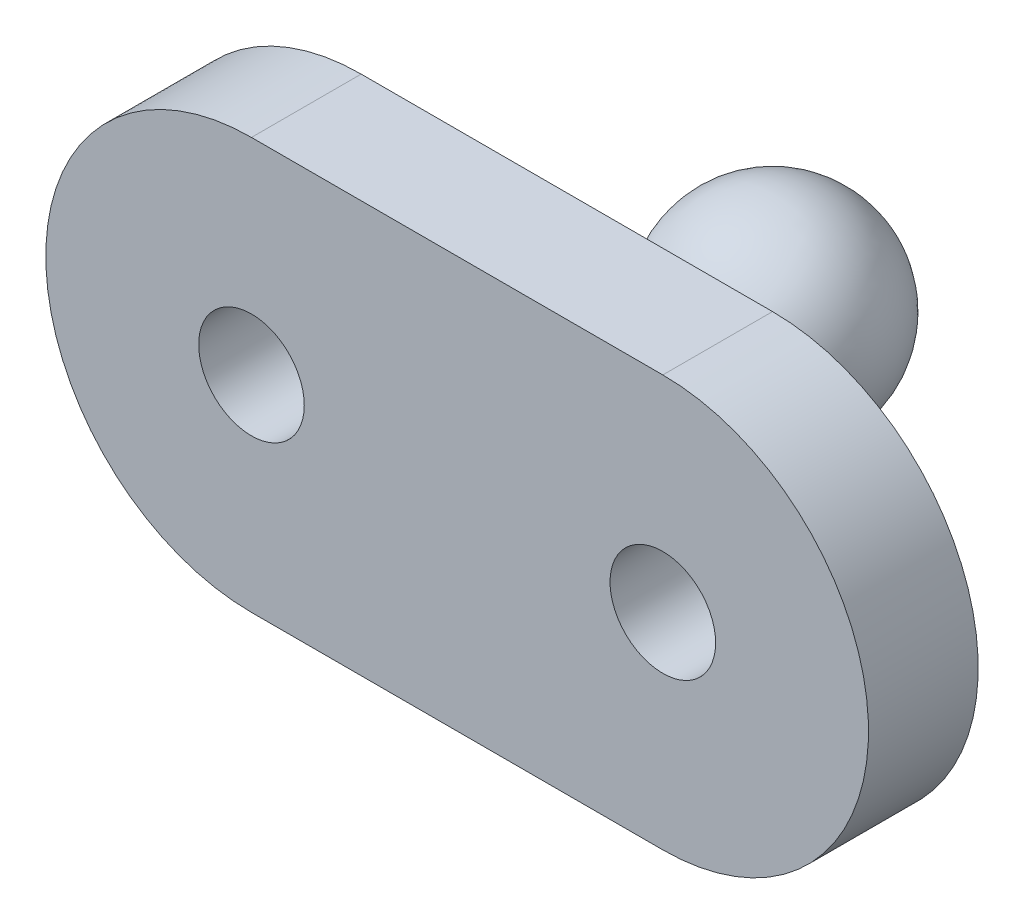
ISO-10303-21;
HEADER;
FILE_DESCRIPTION(('STEP AP214'),'2;1');
FILE_NAME('part.step','',(''),(''),'','','');
FILE_SCHEMA(('AUTOMOTIVE_DESIGN { 1 0 10303 214 1 1 1 1 }'));
ENDSEC;
DATA;
#1=APPLICATION_CONTEXT('core data for automotive mechanical design processes');
#2=APPLICATION_PROTOCOL_DEFINITION('international standard','automotive_design',2000,#1);
#3=PRODUCT_CONTEXT('',#1,'mechanical');
#4=PRODUCT('Part','Part','',(#3));
#5=PRODUCT_RELATED_PRODUCT_CATEGORY('part','',(#4));
#6=PRODUCT_DEFINITION_FORMATION('','',#4);
#7=PRODUCT_DEFINITION_CONTEXT('part definition',#1,'design');
#8=PRODUCT_DEFINITION('design','',#6,#7);
#9=PRODUCT_DEFINITION_SHAPE('','',#8);
#10=(LENGTH_UNIT() NAMED_UNIT(*) SI_UNIT(.MILLI.,.METRE.));
#11=(NAMED_UNIT(*) PLANE_ANGLE_UNIT() SI_UNIT($,.RADIAN.));
#12=(NAMED_UNIT(*) SI_UNIT($,.STERADIAN.) SOLID_ANGLE_UNIT());
#13=UNCERTAINTY_MEASURE_WITH_UNIT(LENGTH_MEASURE(1.E-05),#10,'distance_accuracy_value','');
#14=(GEOMETRIC_REPRESENTATION_CONTEXT(3) GLOBAL_UNCERTAINTY_ASSIGNED_CONTEXT((#13)) GLOBAL_UNIT_ASSIGNED_CONTEXT((#10,
#11,#12)) REPRESENTATION_CONTEXT('',''));
#15=CARTESIAN_POINT('',(0.,0.,0.));
#16=DIRECTION('',(0.,0.,1.));
#17=DIRECTION('',(1.,0.,0.));
#18=AXIS2_PLACEMENT_3D('',#15,#16,#17);
#19=CARTESIAN_POINT('',(-7.5,0.,4.));
#20=DIRECTION('',(0.,0.,1.));
#21=DIRECTION('',(1.,0.,0.));
#22=AXIS2_PLACEMENT_3D('',#19,#20,#21);
#23=PLANE('',#22);
#24=CARTESIAN_POINT('',(7.5,0.,4.));
#25=DIRECTION('',(0.,0.,1.));
#26=DIRECTION('',(1.,0.,0.));
#27=AXIS2_PLACEMENT_3D('',#24,#25,#26);
#28=CIRCLE('',#27,1.925);
#29=CARTESIAN_POINT('',(9.425,0.,4.));
#30=VERTEX_POINT('',#29);
#31=EDGE_CURVE('E113',#30,#30,#28,.T.);
#32=ORIENTED_EDGE('',*,*,#31,.F.);
#33=EDGE_LOOP('',(#32));
#34=FACE_BOUND('',#33,.T.);
#35=CARTESIAN_POINT('',(-7.5,0.,4.));
#36=DIRECTION('',(0.,0.,1.));
#37=DIRECTION('',(1.,0.,0.));
#38=AXIS2_PLACEMENT_3D('',#35,#36,#37);
#39=CIRCLE('',#38,7.5);
#40=CARTESIAN_POINT('',(-7.5,7.5,4.));
#41=VERTEX_POINT('',#40);
#42=CARTESIAN_POINT('',(-7.5,-7.5,4.));
#43=VERTEX_POINT('',#42);
#44=EDGE_CURVE('E95',#41,#43,#39,.T.);
#45=ORIENTED_EDGE('',*,*,#44,.T.);
#46=DIRECTION('',(1.,0.,0.));
#47=VECTOR('',#46,1.);
#48=CARTESIAN_POINT('',(-7.5,-7.5,4.));
#49=LINE('',#48,#47);
#50=CARTESIAN_POINT('',(7.5,-7.5,4.));
#51=VERTEX_POINT('',#50);
#52=EDGE_CURVE('E90',#43,#51,#49,.T.);
#53=ORIENTED_EDGE('',*,*,#52,.T.);
#54=CARTESIAN_POINT('',(7.5,0.,4.));
#55=DIRECTION('',(0.,0.,1.));
#56=DIRECTION('',(1.,0.,0.));
#57=AXIS2_PLACEMENT_3D('',#54,#55,#56);
#58=CIRCLE('',#57,7.5);
#59=CARTESIAN_POINT('',(7.5,7.50000000000001,4.));
#60=VERTEX_POINT('',#59);
#61=EDGE_CURVE('E93',#51,#60,#58,.T.);
#62=ORIENTED_EDGE('',*,*,#61,.T.);
#63=DIRECTION('',(-1.,0.,0.));
#64=VECTOR('',#63,1.);
#65=CARTESIAN_POINT('',(-7.5,7.5,4.));
#66=LINE('',#65,#64);
#67=EDGE_CURVE('E59',#60,#41,#66,.T.);
#68=ORIENTED_EDGE('',*,*,#67,.T.);
#69=EDGE_LOOP('',(#45,#53,#62,#68));
#70=FACE_BOUND('',#69,.T.);
#71=CARTESIAN_POINT('',(-7.5,0.,4.));
#72=DIRECTION('',(0.,0.,1.));
#73=DIRECTION('',(1.,0.,0.));
#74=AXIS2_PLACEMENT_3D('',#71,#72,#73);
#75=CIRCLE('',#74,1.925);
#76=CARTESIAN_POINT('',(-5.575,0.,4.));
#77=VERTEX_POINT('',#76);
#78=EDGE_CURVE('E171',#77,#77,#75,.T.);
#79=ORIENTED_EDGE('',*,*,#78,.F.);
#80=EDGE_LOOP('',(#79));
#81=FACE_BOUND('',#80,.T.);
#82=ADVANCED_FACE('F42',(#34,#70,#81),#23,.T.);
#83=CARTESIAN_POINT('',(-7.5,0.,0.));
#84=DIRECTION('',(0.,0.,1.));
#85=DIRECTION('',(1.,0.,0.));
#86=AXIS2_PLACEMENT_3D('',#83,#84,#85);
#87=PLANE('',#86);
#88=CARTESIAN_POINT('',(0.,0.,0.));
#89=DIRECTION('',(0.,0.,1.));
#90=DIRECTION('',(1.,0.,0.));
#91=AXIS2_PLACEMENT_3D('',#88,#89,#90);
#92=CIRCLE('',#91,5.21496268633627);
#93=CARTESIAN_POINT('',(5.21496268633627,0.,0.));
#94=VERTEX_POINT('',#93);
#95=EDGE_CURVE('E11',#94,#94,#92,.T.);
#96=ORIENTED_EDGE('',*,*,#95,.T.);
#97=EDGE_LOOP('',(#96));
#98=FACE_BOUND('',#97,.T.);
#99=CARTESIAN_POINT('',(-7.5,0.,0.));
#100=DIRECTION('',(0.,0.,1.));
#101=DIRECTION('',(1.,0.,0.));
#102=AXIS2_PLACEMENT_3D('',#99,#100,#101);
#103=CIRCLE('',#102,7.5);
#104=CARTESIAN_POINT('',(-7.5,7.5,0.));
#105=VERTEX_POINT('',#104);
#106=CARTESIAN_POINT('',(-7.5,-7.5,0.));
#107=VERTEX_POINT('',#106);
#108=EDGE_CURVE('E110',#105,#107,#103,.T.);
#109=ORIENTED_EDGE('',*,*,#108,.F.);
#110=DIRECTION('',(-1.,0.,0.));
#111=VECTOR('',#110,1.);
#112=CARTESIAN_POINT('',(-7.5,7.5,0.));
#113=LINE('',#112,#111);
#114=CARTESIAN_POINT('',(7.5,7.50000000000001,0.));
#115=VERTEX_POINT('',#114);
#116=EDGE_CURVE('E82',#115,#105,#113,.T.);
#117=ORIENTED_EDGE('',*,*,#116,.F.);
#118=CARTESIAN_POINT('',(7.5,0.,0.));
#119=DIRECTION('',(0.,0.,1.));
#120=DIRECTION('',(1.,0.,0.));
#121=AXIS2_PLACEMENT_3D('',#118,#119,#120);
#122=CIRCLE('',#121,7.5);
#123=CARTESIAN_POINT('',(7.5,-7.5,0.));
#124=VERTEX_POINT('',#123);
#125=EDGE_CURVE('E76',#124,#115,#122,.T.);
#126=ORIENTED_EDGE('',*,*,#125,.F.);
#127=DIRECTION('',(1.,0.,0.));
#128=VECTOR('',#127,1.);
#129=CARTESIAN_POINT('',(-7.5,-7.5,0.));
#130=LINE('',#129,#128);
#131=EDGE_CURVE('E100',#107,#124,#130,.T.);
#132=ORIENTED_EDGE('',*,*,#131,.F.);
#133=EDGE_LOOP('',(#109,#117,#126,#132));
#134=FACE_BOUND('',#133,.T.);
#135=CARTESIAN_POINT('',(7.5,0.,0.));
#136=DIRECTION('',(0.,0.,1.));
#137=DIRECTION('',(1.,0.,0.));
#138=AXIS2_PLACEMENT_3D('',#135,#136,#137);
#139=CIRCLE('',#138,1.925);
#140=CARTESIAN_POINT('',(9.425,0.,0.));
#141=VERTEX_POINT('',#140);
#142=EDGE_CURVE('E166',#141,#141,#139,.T.);
#143=ORIENTED_EDGE('',*,*,#142,.T.);
#144=EDGE_LOOP('',(#143));
#145=FACE_BOUND('',#144,.T.);
#146=CARTESIAN_POINT('',(-7.5,0.,0.));
#147=DIRECTION('',(0.,0.,1.));
#148=DIRECTION('',(1.,0.,0.));
#149=AXIS2_PLACEMENT_3D('',#146,#147,#148);
#150=CIRCLE('',#149,1.925);
#151=CARTESIAN_POINT('',(-5.575,0.,0.));
#152=VERTEX_POINT('',#151);
#153=EDGE_CURVE('E169',#152,#152,#150,.T.);
#154=ORIENTED_EDGE('',*,*,#153,.T.);
#155=EDGE_LOOP('',(#154));
#156=FACE_BOUND('',#155,.T.);
#157=ADVANCED_FACE('F136',(#98,#134,#145,#156),#87,.F.);
#158=CARTESIAN_POINT('',(-7.5,0.,4.));
#159=DIRECTION('',(0.,0.,-1.));
#160=DIRECTION('',(-1.,0.,0.));
#161=AXIS2_PLACEMENT_3D('',#158,#159,#160);
#162=CYLINDRICAL_SURFACE('',#161,7.5);
#163=ORIENTED_EDGE('',*,*,#108,.T.);
#164=DIRECTION('',(0.,0.,-1.));
#165=VECTOR('',#164,1.);
#166=CARTESIAN_POINT('',(-7.5,-7.5,4.));
#167=LINE('',#166,#165);
#168=EDGE_CURVE('E101',#43,#107,#167,.T.);
#169=ORIENTED_EDGE('',*,*,#168,.F.);
#170=ORIENTED_EDGE('',*,*,#44,.F.);
#171=DIRECTION('',(0.,0.,-1.));
#172=VECTOR('',#171,1.);
#173=CARTESIAN_POINT('',(-7.5,7.5,4.));
#174=LINE('',#173,#172);
#175=EDGE_CURVE('E106',#41,#105,#174,.T.);
#176=ORIENTED_EDGE('',*,*,#175,.T.);
#177=EDGE_LOOP('',(#163,#169,#170,#176));
#178=FACE_BOUND('',#177,.T.);
#179=ADVANCED_FACE('F143',(#178),#162,.T.);
#180=CARTESIAN_POINT('',(-7.5,-7.5,4.));
#181=DIRECTION('',(0.,1.,0.));
#182=DIRECTION('',(-1.,0.,0.));
#183=AXIS2_PLACEMENT_3D('',#180,#181,#182);
#184=PLANE('',#183);
#185=ORIENTED_EDGE('',*,*,#131,.T.);
#186=DIRECTION('',(0.,0.,-1.));
#187=VECTOR('',#186,1.);
#188=CARTESIAN_POINT('',(7.5,-7.5,4.));
#189=LINE('',#188,#187);
#190=EDGE_CURVE('E98',#51,#124,#189,.T.);
#191=ORIENTED_EDGE('',*,*,#190,.F.);
#192=ORIENTED_EDGE('',*,*,#52,.F.);
#193=ORIENTED_EDGE('',*,*,#168,.T.);
#194=EDGE_LOOP('',(#185,#191,#192,#193));
#195=FACE_BOUND('',#194,.T.);
#196=ADVANCED_FACE('F99',(#195),#184,.F.);
#197=CARTESIAN_POINT('',(7.5,0.,4.));
#198=DIRECTION('',(0.,0.,-1.));
#199=DIRECTION('',(-1.,0.,0.));
#200=AXIS2_PLACEMENT_3D('',#197,#198,#199);
#201=CYLINDRICAL_SURFACE('',#200,7.5);
#202=ORIENTED_EDGE('',*,*,#125,.T.);
#203=DIRECTION('',(0.,0.,-1.));
#204=VECTOR('',#203,1.);
#205=CARTESIAN_POINT('',(7.5,7.50000000000001,4.));
#206=LINE('',#205,#204);
#207=EDGE_CURVE('E102',#60,#115,#206,.T.);
#208=ORIENTED_EDGE('',*,*,#207,.F.);
#209=ORIENTED_EDGE('',*,*,#61,.F.);
#210=ORIENTED_EDGE('',*,*,#190,.T.);
#211=EDGE_LOOP('',(#202,#208,#209,#210));
#212=FACE_BOUND('',#211,.T.);
#213=ADVANCED_FACE('F104',(#212),#201,.T.);
#214=CARTESIAN_POINT('',(-7.5,7.5,4.));
#215=DIRECTION('',(0.,-1.,0.));
#216=DIRECTION('',(1.,0.,0.));
#217=AXIS2_PLACEMENT_3D('',#214,#215,#216);
#218=PLANE('',#217);
#219=ORIENTED_EDGE('',*,*,#116,.T.);
#220=ORIENTED_EDGE('',*,*,#175,.F.);
#221=ORIENTED_EDGE('',*,*,#67,.F.);
#222=ORIENTED_EDGE('',*,*,#207,.T.);
#223=EDGE_LOOP('',(#219,#220,#221,#222));
#224=FACE_BOUND('',#223,.T.);
#225=ADVANCED_FACE('F151',(#224),#218,.F.);
#226=CARTESIAN_POINT('',(7.5,0.,4.));
#227=DIRECTION('',(0.,0.,-1.));
#228=DIRECTION('',(-1.,0.,0.));
#229=AXIS2_PLACEMENT_3D('',#226,#227,#228);
#230=CYLINDRICAL_SURFACE('',#229,1.925);
#231=ORIENTED_EDGE('',*,*,#31,.T.);
#232=EDGE_LOOP('',(#231));
#233=FACE_BOUND('',#232,.T.);
#234=ORIENTED_EDGE('',*,*,#142,.F.);
#235=EDGE_LOOP('',(#234));
#236=FACE_BOUND('',#235,.T.);
#237=ADVANCED_FACE('F148',(#233,#236),#230,.F.);
#238=CARTESIAN_POINT('',(-7.5,0.,4.));
#239=DIRECTION('',(0.,0.,-1.));
#240=DIRECTION('',(-1.,0.,0.));
#241=AXIS2_PLACEMENT_3D('',#238,#239,#240);
#242=CYLINDRICAL_SURFACE('',#241,1.925);
#243=ORIENTED_EDGE('',*,*,#78,.T.);
#244=EDGE_LOOP('',(#243));
#245=FACE_BOUND('',#244,.T.);
#246=ORIENTED_EDGE('',*,*,#153,.F.);
#247=EDGE_LOOP('',(#246));
#248=FACE_BOUND('',#247,.T.);
#249=ADVANCED_FACE('F184',(#245,#248),#242,.F.);
#250=CARTESIAN_POINT('',(0.,0.,-4.36855694979735));
#251=DIRECTION('',(0.,0.,1.));
#252=DIRECTION('',(1.,0.,0.));
#253=AXIS2_PLACEMENT_3D('',#250,#251,#252);
#254=CONICAL_SURFACE('',#253,2.06314430502027,0.0996686524911618);
#255=CARTESIAN_POINT('',(0.,0.,-2.701488842937));
#256=DIRECTION('',(0.,0.,1.));
#257=DIRECTION('',(1.,0.,0.));
#258=AXIS2_PLACEMENT_3D('',#255,#256,#257);
#259=CIRCLE('',#258,2.2298511157063);
#260=CARTESIAN_POINT('',(2.2298511157063,0.,-2.701488842937));
#261=VERTEX_POINT('',#260);
#262=EDGE_CURVE('E51',#261,#261,#259,.F.);
#263=ORIENTED_EDGE('',*,*,#262,.T.);
#264=EDGE_LOOP('',(#263));
#265=FACE_BOUND('',#264,.T.);
#266=CARTESIAN_POINT('',(0.,0.,-4.36855694979735));
#267=DIRECTION('',(0.,0.,1.));
#268=DIRECTION('',(1.,0.,0.));
#269=AXIS2_PLACEMENT_3D('',#266,#267,#268);
#270=CIRCLE('',#269,2.06314430502027);
#271=CARTESIAN_POINT('',(2.06314430502027,0.,-4.36855694979735));
#272=VERTEX_POINT('',#271);
#273=EDGE_CURVE('E172',#272,#272,#270,.T.);
#274=ORIENTED_EDGE('',*,*,#273,.T.);
#275=EDGE_LOOP('',(#274));
#276=FACE_BOUND('',#275,.T.);
#277=ADVANCED_FACE('F122',(#265,#276),#254,.T.);
#278=CARTESIAN_POINT('',(0.,0.,-7.5));
#279=DIRECTION('',(0.,0.,1.));
#280=DIRECTION('',(1.,0.,0.));
#281=AXIS2_PLACEMENT_3D('',#278,#279,#280);
#282=SPHERICAL_SURFACE('',#281,3.75);
#283=ORIENTED_EDGE('',*,*,#273,.F.);
#284=EDGE_LOOP('',(#283));
#285=FACE_BOUND('',#284,.T.);
#286=ADVANCED_FACE('F126',(#285),#282,.T.);
#287=CARTESIAN_POINT('',(0.,0.,-3.));
#288=DIRECTION('',(0.,0.,1.));
#289=DIRECTION('',(1.,0.,0.));
#290=AXIS2_PLACEMENT_3D('',#287,#288,#289);
#291=TOROIDAL_SURFACE('',#290,5.21496268633627,3.);
#292=ORIENTED_EDGE('',*,*,#95,.F.);
#293=EDGE_LOOP('',(#292));
#294=FACE_BOUND('',#293,.T.);
#295=ORIENTED_EDGE('',*,*,#262,.F.);
#296=EDGE_LOOP('',(#295));
#297=FACE_BOUND('',#296,.T.);
#298=ADVANCED_FACE('F44',(#294,#297),#291,.F.);
#299=CLOSED_SHELL('',(#82,#157,#179,#196,#213,#225,#237,#249,#277,#286,#298));
#300=MANIFOLD_SOLID_BREP('B2',#299);
#301=ADVANCED_BREP_SHAPE_REPRESENTATION('',(#18,#300),#14);
#302=SHAPE_DEFINITION_REPRESENTATION(#9,#301);
ENDSEC;
END-ISO-10303-21;
